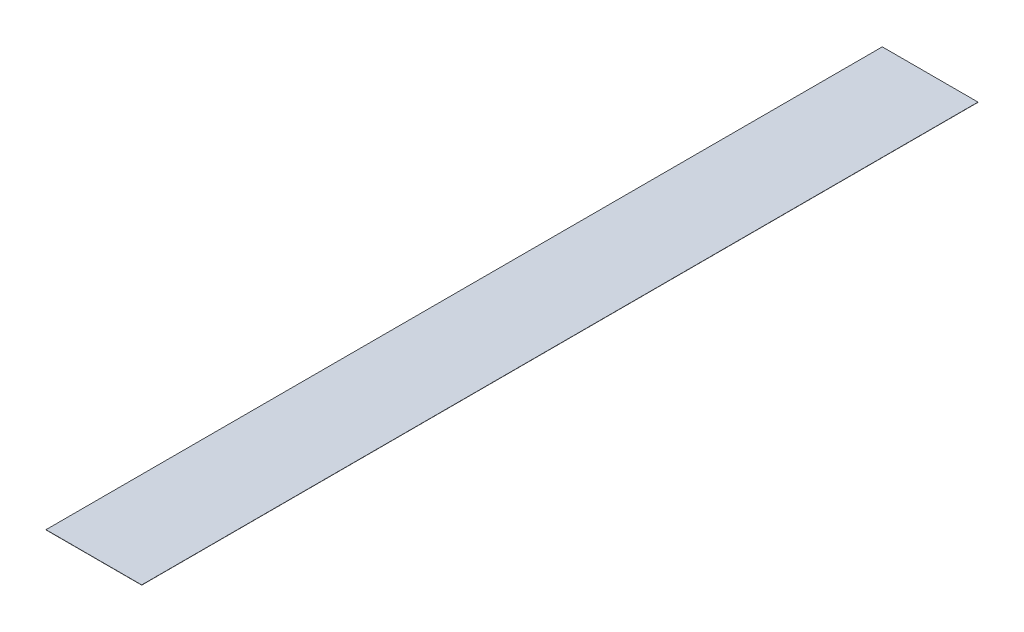
ISO-10303-21;
HEADER;
FILE_DESCRIPTION(('STEP AP214'),'2;1');
FILE_NAME('part.step','',(''),(''),'','','');
FILE_SCHEMA(('AUTOMOTIVE_DESIGN { 1 0 10303 214 1 1 1 1 }'));
ENDSEC;
DATA;
#1=APPLICATION_CONTEXT('core data for automotive mechanical design processes');
#2=APPLICATION_PROTOCOL_DEFINITION('international standard','automotive_design',2000,#1);
#3=PRODUCT_CONTEXT('',#1,'mechanical');
#4=PRODUCT('Part','Part','',(#3));
#5=PRODUCT_RELATED_PRODUCT_CATEGORY('part','',(#4));
#6=PRODUCT_DEFINITION_FORMATION('','',#4);
#7=PRODUCT_DEFINITION_CONTEXT('part definition',#1,'design');
#8=PRODUCT_DEFINITION('design','',#6,#7);
#9=PRODUCT_DEFINITION_SHAPE('','',#8);
#10=(LENGTH_UNIT() NAMED_UNIT(*) SI_UNIT(.MILLI.,.METRE.));
#11=(NAMED_UNIT(*) PLANE_ANGLE_UNIT() SI_UNIT($,.RADIAN.));
#12=(NAMED_UNIT(*) SI_UNIT($,.STERADIAN.) SOLID_ANGLE_UNIT());
#13=UNCERTAINTY_MEASURE_WITH_UNIT(LENGTH_MEASURE(1.E-05),#10,'distance_accuracy_value','');
#14=(GEOMETRIC_REPRESENTATION_CONTEXT(3) GLOBAL_UNCERTAINTY_ASSIGNED_CONTEXT((#13)) GLOBAL_UNIT_ASSIGNED_CONTEXT((#10,
#11,#12)) REPRESENTATION_CONTEXT('',''));
#15=CARTESIAN_POINT('',(0.,0.,0.));
#16=DIRECTION('',(0.,0.,1.));
#17=DIRECTION('',(1.,0.,0.));
#18=AXIS2_PLACEMENT_3D('',#15,#16,#17);
#19=CARTESIAN_POINT('',(-11.615,0.0508,-101.495));
#20=DIRECTION('',(1.,0.,0.));
#21=DIRECTION('',(0.,0.,-1.));
#22=AXIS2_PLACEMENT_3D('',#19,#20,#21);
#23=PLANE('',#22);
#24=DIRECTION('',(0.,0.,1.));
#25=VECTOR('',#24,1.);
#26=CARTESIAN_POINT('',(-11.615,0.,-101.495));
#27=LINE('',#26,#25);
#28=CARTESIAN_POINT('',(-11.615,0.,-101.495));
#29=VERTEX_POINT('',#28);
#30=CARTESIAN_POINT('',(-11.615,0.,101.495));
#31=VERTEX_POINT('',#30);
#32=EDGE_CURVE('E114',#29,#31,#27,.T.);
#33=ORIENTED_EDGE('',*,*,#32,.T.);
#34=DIRECTION('',(0.,-1.,0.));
#35=VECTOR('',#34,1.);
#36=CARTESIAN_POINT('',(-11.615,0.0508,101.495));
#37=LINE('',#36,#35);
#38=CARTESIAN_POINT('',(-11.615,0.0508,101.495));
#39=VERTEX_POINT('',#38);
#40=EDGE_CURVE('E11',#39,#31,#37,.T.);
#41=ORIENTED_EDGE('',*,*,#40,.F.);
#42=DIRECTION('',(0.,0.,1.));
#43=VECTOR('',#42,1.);
#44=CARTESIAN_POINT('',(-11.615,0.0508,-101.495));
#45=LINE('',#44,#43);
#46=CARTESIAN_POINT('',(-11.615,0.0508,-101.495));
#47=VERTEX_POINT('',#46);
#48=EDGE_CURVE('E97',#47,#39,#45,.T.);
#49=ORIENTED_EDGE('',*,*,#48,.F.);
#50=DIRECTION('',(0.,-1.,0.));
#51=VECTOR('',#50,1.);
#52=CARTESIAN_POINT('',(-11.615,0.0508,-101.495));
#53=LINE('',#52,#51);
#54=EDGE_CURVE('E110',#47,#29,#53,.T.);
#55=ORIENTED_EDGE('',*,*,#54,.T.);
#56=EDGE_LOOP('',(#33,#41,#49,#55));
#57=FACE_BOUND('',#56,.T.);
#58=ADVANCED_FACE('F39',(#57),#23,.F.);
#59=CARTESIAN_POINT('',(-11.615,0.0508,101.495));
#60=DIRECTION('',(0.,0.,-1.));
#61=DIRECTION('',(-1.,0.,0.));
#62=AXIS2_PLACEMENT_3D('',#59,#60,#61);
#63=PLANE('',#62);
#64=DIRECTION('',(1.,0.,0.));
#65=VECTOR('',#64,1.);
#66=CARTESIAN_POINT('',(-11.615,0.,101.495));
#67=LINE('',#66,#65);
#68=CARTESIAN_POINT('',(11.615,0.,101.495));
#69=VERTEX_POINT('',#68);
#70=EDGE_CURVE('E102',#31,#69,#67,.T.);
#71=ORIENTED_EDGE('',*,*,#70,.T.);
#72=DIRECTION('',(0.,-1.,0.));
#73=VECTOR('',#72,1.);
#74=CARTESIAN_POINT('',(11.615,0.0508,101.495));
#75=LINE('',#74,#73);
#76=CARTESIAN_POINT('',(11.615,0.0508,101.495));
#77=VERTEX_POINT('',#76);
#78=EDGE_CURVE('E48',#77,#69,#75,.T.);
#79=ORIENTED_EDGE('',*,*,#78,.F.);
#80=DIRECTION('',(1.,0.,0.));
#81=VECTOR('',#80,1.);
#82=CARTESIAN_POINT('',(-11.615,0.0508,101.495));
#83=LINE('',#82,#81);
#84=EDGE_CURVE('E91',#39,#77,#83,.T.);
#85=ORIENTED_EDGE('',*,*,#84,.F.);
#86=ORIENTED_EDGE('',*,*,#40,.T.);
#87=EDGE_LOOP('',(#71,#79,#85,#86));
#88=FACE_BOUND('',#87,.T.);
#89=ADVANCED_FACE('F101',(#88),#63,.F.);
#90=CARTESIAN_POINT('',(11.615,0.0508,-101.495));
#91=DIRECTION('',(-1.,0.,0.));
#92=DIRECTION('',(0.,0.,1.));
#93=AXIS2_PLACEMENT_3D('',#90,#91,#92);
#94=PLANE('',#93);
#95=DIRECTION('',(0.,0.,-1.));
#96=VECTOR('',#95,1.);
#97=CARTESIAN_POINT('',(11.615,0.,-101.495));
#98=LINE('',#97,#96);
#99=CARTESIAN_POINT('',(11.615,0.,-101.495));
#100=VERTEX_POINT('',#99);
#101=EDGE_CURVE('E77',#69,#100,#98,.T.);
#102=ORIENTED_EDGE('',*,*,#101,.T.);
#103=DIRECTION('',(0.,-1.,0.));
#104=VECTOR('',#103,1.);
#105=CARTESIAN_POINT('',(11.615,0.0508,-101.495));
#106=LINE('',#105,#104);
#107=CARTESIAN_POINT('',(11.615,0.0508,-101.495));
#108=VERTEX_POINT('',#107);
#109=EDGE_CURVE('E104',#108,#100,#106,.T.);
#110=ORIENTED_EDGE('',*,*,#109,.F.);
#111=DIRECTION('',(0.,0.,-1.));
#112=VECTOR('',#111,1.);
#113=CARTESIAN_POINT('',(11.615,0.0508,-101.495));
#114=LINE('',#113,#112);
#115=EDGE_CURVE('E95',#77,#108,#114,.T.);
#116=ORIENTED_EDGE('',*,*,#115,.F.);
#117=ORIENTED_EDGE('',*,*,#78,.T.);
#118=EDGE_LOOP('',(#102,#110,#116,#117));
#119=FACE_BOUND('',#118,.T.);
#120=ADVANCED_FACE('F105',(#119),#94,.F.);
#121=CARTESIAN_POINT('',(-11.615,0.0508,-101.495));
#122=DIRECTION('',(0.,0.,1.));
#123=DIRECTION('',(1.,0.,0.));
#124=AXIS2_PLACEMENT_3D('',#121,#122,#123);
#125=PLANE('',#124);
#126=DIRECTION('',(-1.,0.,0.));
#127=VECTOR('',#126,1.);
#128=CARTESIAN_POINT('',(-11.615,0.,-101.495));
#129=LINE('',#128,#127);
#130=EDGE_CURVE('E83',#100,#29,#129,.T.);
#131=ORIENTED_EDGE('',*,*,#130,.T.);
#132=ORIENTED_EDGE('',*,*,#54,.F.);
#133=DIRECTION('',(-1.,0.,0.));
#134=VECTOR('',#133,1.);
#135=CARTESIAN_POINT('',(-11.615,0.0508,-101.495));
#136=LINE('',#135,#134);
#137=EDGE_CURVE('E59',#108,#47,#136,.T.);
#138=ORIENTED_EDGE('',*,*,#137,.F.);
#139=ORIENTED_EDGE('',*,*,#109,.T.);
#140=EDGE_LOOP('',(#131,#132,#138,#139));
#141=FACE_BOUND('',#140,.T.);
#142=ADVANCED_FACE('F125',(#141),#125,.F.);
#143=CARTESIAN_POINT('',(-11.615,0.0508,101.495));
#144=DIRECTION('',(0.,1.,0.));
#145=DIRECTION('',(0.,0.,1.));
#146=AXIS2_PLACEMENT_3D('',#143,#144,#145);
#147=PLANE('',#146);
#148=ORIENTED_EDGE('',*,*,#48,.T.);
#149=ORIENTED_EDGE('',*,*,#84,.T.);
#150=ORIENTED_EDGE('',*,*,#115,.T.);
#151=ORIENTED_EDGE('',*,*,#137,.T.);
#152=EDGE_LOOP('',(#148,#149,#150,#151));
#153=FACE_BOUND('',#152,.T.);
#154=ADVANCED_FACE('F93',(#153),#147,.T.);
#155=CARTESIAN_POINT('',(-11.615,0.,101.495));
#156=DIRECTION('',(0.,1.,0.));
#157=DIRECTION('',(0.,0.,1.));
#158=AXIS2_PLACEMENT_3D('',#155,#156,#157);
#159=PLANE('',#158);
#160=ORIENTED_EDGE('',*,*,#32,.F.);
#161=ORIENTED_EDGE('',*,*,#130,.F.);
#162=ORIENTED_EDGE('',*,*,#101,.F.);
#163=ORIENTED_EDGE('',*,*,#70,.F.);
#164=EDGE_LOOP('',(#160,#161,#162,#163));
#165=FACE_BOUND('',#164,.T.);
#166=ADVANCED_FACE('F128',(#165),#159,.F.);
#167=CLOSED_SHELL('',(#58,#89,#120,#142,#154,#166));
#168=MANIFOLD_SOLID_BREP('B2',#167);
#169=ADVANCED_BREP_SHAPE_REPRESENTATION('',(#18,#168),#14);
#170=SHAPE_DEFINITION_REPRESENTATION(#9,#169);
ENDSEC;
END-ISO-10303-21;
